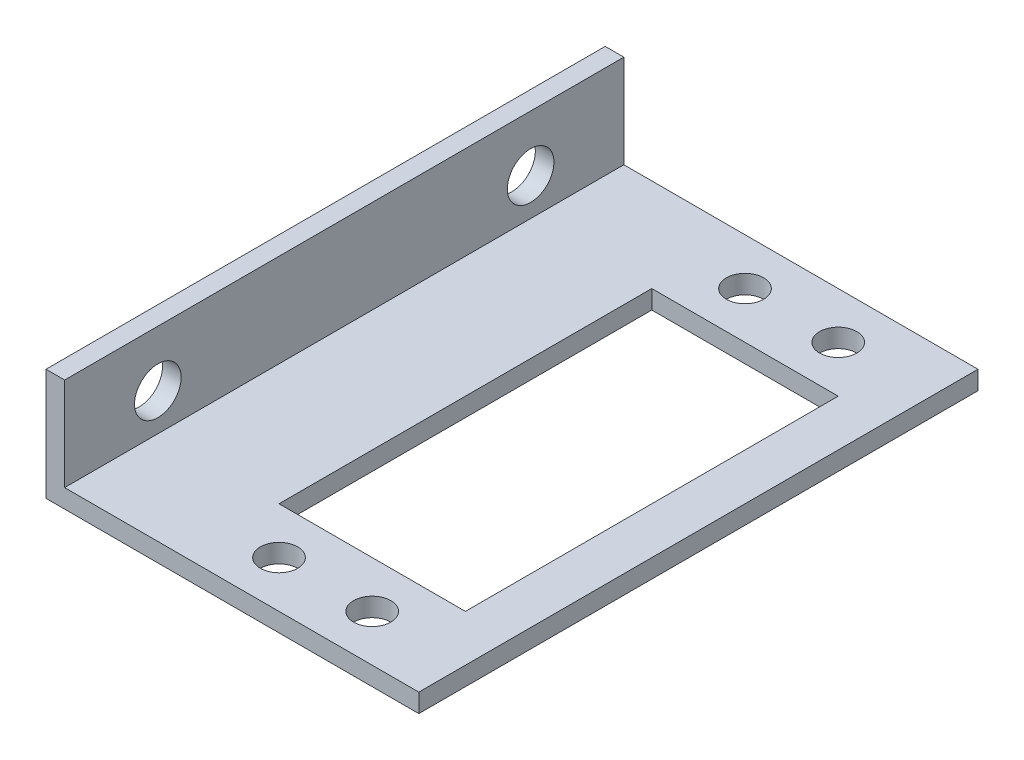
ISO-10303-21;
HEADER;
FILE_DESCRIPTION(('STEP AP214'),'2;1');
FILE_NAME('part.step','',(''),(''),'','','');
FILE_SCHEMA(('AUTOMOTIVE_DESIGN { 1 0 10303 214 1 1 1 1 }'));
ENDSEC;
DATA;
#1=APPLICATION_CONTEXT('core data for automotive mechanical design processes');
#2=APPLICATION_PROTOCOL_DEFINITION('international standard','automotive_design',2000,#1);
#3=PRODUCT_CONTEXT('',#1,'mechanical');
#4=PRODUCT('Part','Part','',(#3));
#5=PRODUCT_RELATED_PRODUCT_CATEGORY('part','',(#4));
#6=PRODUCT_DEFINITION_FORMATION('','',#4);
#7=PRODUCT_DEFINITION_CONTEXT('part definition',#1,'design');
#8=PRODUCT_DEFINITION('design','',#6,#7);
#9=PRODUCT_DEFINITION_SHAPE('','',#8);
#10=(LENGTH_UNIT() NAMED_UNIT(*) SI_UNIT(.MILLI.,.METRE.));
#11=(NAMED_UNIT(*) PLANE_ANGLE_UNIT() SI_UNIT($,.RADIAN.));
#12=(NAMED_UNIT(*) SI_UNIT($,.STERADIAN.) SOLID_ANGLE_UNIT());
#13=UNCERTAINTY_MEASURE_WITH_UNIT(LENGTH_MEASURE(1.E-05),#10,'distance_accuracy_value','');
#14=(GEOMETRIC_REPRESENTATION_CONTEXT(3) GLOBAL_UNCERTAINTY_ASSIGNED_CONTEXT((#13)) GLOBAL_UNIT_ASSIGNED_CONTEXT((#10,
#11,#12)) REPRESENTATION_CONTEXT('',''));
#15=CARTESIAN_POINT('',(0.,0.,0.));
#16=DIRECTION('',(0.,0.,1.));
#17=DIRECTION('',(1.,0.,0.));
#18=AXIS2_PLACEMENT_3D('',#15,#16,#17);
#19=CARTESIAN_POINT('',(-27.3869148760206,0.,60.));
#20=DIRECTION('',(1.,0.,0.));
#21=DIRECTION('',(0.,0.,-1.));
#22=AXIS2_PLACEMENT_3D('',#19,#20,#21);
#23=PLANE('',#22);
#24=CARTESIAN_POINT('',(-27.3869148760206,6.,10.));
#25=DIRECTION('',(-1.,0.,0.));
#26=DIRECTION('',(0.,0.,1.));
#27=AXIS2_PLACEMENT_3D('',#24,#25,#26);
#28=CIRCLE('',#27,2.5);
#29=CARTESIAN_POINT('',(-27.3869148760206,6.,12.5));
#30=VERTEX_POINT('',#29);
#31=EDGE_CURVE('E154',#30,#30,#28,.T.);
#32=ORIENTED_EDGE('',*,*,#31,.F.);
#33=EDGE_LOOP('',(#32));
#34=FACE_BOUND('',#33,.T.);
#35=CARTESIAN_POINT('',(-27.3869148760206,6.,50.));
#36=DIRECTION('',(-1.,0.,0.));
#37=DIRECTION('',(0.,0.,1.));
#38=AXIS2_PLACEMENT_3D('',#35,#36,#37);
#39=CIRCLE('',#38,2.5);
#40=CARTESIAN_POINT('',(-27.3869148760206,6.,52.5));
#41=VERTEX_POINT('',#40);
#42=EDGE_CURVE('E159',#41,#41,#39,.T.);
#43=ORIENTED_EDGE('',*,*,#42,.F.);
#44=EDGE_LOOP('',(#43));
#45=FACE_BOUND('',#44,.T.);
#46=DIRECTION('',(0.,-1.,0.));
#47=VECTOR('',#46,1.);
#48=CARTESIAN_POINT('',(-27.3869148760206,0.,0.));
#49=LINE('',#48,#47);
#50=CARTESIAN_POINT('',(-27.3869148760206,12.,0.));
#51=VERTEX_POINT('',#50);
#52=CARTESIAN_POINT('',(-27.3869148760206,0.,0.));
#53=VERTEX_POINT('',#52);
#54=EDGE_CURVE('E184',#51,#53,#49,.T.);
#55=ORIENTED_EDGE('',*,*,#54,.T.);
#56=DIRECTION('',(0.,0.,-1.));
#57=VECTOR('',#56,1.);
#58=CARTESIAN_POINT('',(-27.3869148760206,0.,60.));
#59=LINE('',#58,#57);
#60=CARTESIAN_POINT('',(-27.3869148760206,0.,60.));
#61=VERTEX_POINT('',#60);
#62=EDGE_CURVE('E222',#61,#53,#59,.T.);
#63=ORIENTED_EDGE('',*,*,#62,.F.);
#64=DIRECTION('',(0.,-1.,0.));
#65=VECTOR('',#64,1.);
#66=CARTESIAN_POINT('',(-27.3869148760206,0.,60.));
#67=LINE('',#66,#65);
#68=CARTESIAN_POINT('',(-27.3869148760206,12.,60.));
#69=VERTEX_POINT('',#68);
#70=EDGE_CURVE('E163',#69,#61,#67,.T.);
#71=ORIENTED_EDGE('',*,*,#70,.F.);
#72=DIRECTION('',(0.,0.,-1.));
#73=VECTOR('',#72,1.);
#74=CARTESIAN_POINT('',(-27.3869148760206,12.,60.));
#75=LINE('',#74,#73);
#76=EDGE_CURVE('E183',#69,#51,#75,.T.);
#77=ORIENTED_EDGE('',*,*,#76,.T.);
#78=EDGE_LOOP('',(#55,#63,#71,#77));
#79=FACE_BOUND('',#78,.T.);
#80=ADVANCED_FACE('F39',(#34,#45,#79),#23,.F.);
#81=CARTESIAN_POINT('',(-27.3869148760206,0.,60.));
#82=DIRECTION('',(0.,1.,0.));
#83=DIRECTION('',(0.,0.,1.));
#84=AXIS2_PLACEMENT_3D('',#81,#82,#83);
#85=PLANE('',#84);
#86=CARTESIAN_POINT('',(2.61308512397936,0.,5.));
#87=DIRECTION('',(0.,-1.,0.));
#88=DIRECTION('',(0.,0.,-1.));
#89=AXIS2_PLACEMENT_3D('',#86,#87,#88);
#90=CIRCLE('',#89,2.);
#91=CARTESIAN_POINT('',(2.61308512397936,0.,3.));
#92=VERTEX_POINT('',#91);
#93=EDGE_CURVE('E352',#92,#92,#90,.T.);
#94=ORIENTED_EDGE('',*,*,#93,.F.);
#95=EDGE_LOOP('',(#94));
#96=FACE_BOUND('',#95,.T.);
#97=CARTESIAN_POINT('',(-7.38691487602064,0.,5.));
#98=DIRECTION('',(0.,-1.,0.));
#99=DIRECTION('',(0.,0.,-1.));
#100=AXIS2_PLACEMENT_3D('',#97,#98,#99);
#101=CIRCLE('',#100,2.);
#102=CARTESIAN_POINT('',(-7.38691487602064,0.,3.));
#103=VERTEX_POINT('',#102);
#104=EDGE_CURVE('E355',#103,#103,#101,.T.);
#105=ORIENTED_EDGE('',*,*,#104,.F.);
#106=EDGE_LOOP('',(#105));
#107=FACE_BOUND('',#106,.T.);
#108=CARTESIAN_POINT('',(2.61308512397936,0.,55.));
#109=DIRECTION('',(0.,-1.,0.));
#110=DIRECTION('',(0.,0.,-1.));
#111=AXIS2_PLACEMENT_3D('',#108,#109,#110);
#112=CIRCLE('',#111,2.);
#113=CARTESIAN_POINT('',(2.61308512397936,0.,53.));
#114=VERTEX_POINT('',#113);
#115=EDGE_CURVE('E349',#114,#114,#112,.T.);
#116=ORIENTED_EDGE('',*,*,#115,.F.);
#117=EDGE_LOOP('',(#116));
#118=FACE_BOUND('',#117,.T.);
#119=CARTESIAN_POINT('',(-7.38691487602064,0.,55.));
#120=DIRECTION('',(0.,-1.,0.));
#121=DIRECTION('',(0.,0.,-1.));
#122=AXIS2_PLACEMENT_3D('',#119,#120,#121);
#123=CIRCLE('',#122,2.);
#124=CARTESIAN_POINT('',(-7.38691487602064,0.,53.));
#125=VERTEX_POINT('',#124);
#126=EDGE_CURVE('E346',#125,#125,#123,.T.);
#127=ORIENTED_EDGE('',*,*,#126,.F.);
#128=EDGE_LOOP('',(#127));
#129=FACE_BOUND('',#128,.T.);
#130=DIRECTION('',(-1.,0.,0.));
#131=VECTOR('',#130,1.);
#132=CARTESIAN_POINT('',(-12.3869148760206,0.,50.));
#133=LINE('',#132,#131);
#134=CARTESIAN_POINT('',(7.61308512397936,0.,50.));
#135=VERTEX_POINT('',#134);
#136=CARTESIAN_POINT('',(-12.3869148760206,0.,50.));
#137=VERTEX_POINT('',#136);
#138=EDGE_CURVE('E131',#135,#137,#133,.T.);
#139=ORIENTED_EDGE('',*,*,#138,.F.);
#140=DIRECTION('',(0.,0.,1.));
#141=VECTOR('',#140,1.);
#142=CARTESIAN_POINT('',(7.61308512397936,0.,50.));
#143=LINE('',#142,#141);
#144=CARTESIAN_POINT('',(7.61308512397937,0.,10.));
#145=VERTEX_POINT('',#144);
#146=EDGE_CURVE('E56',#145,#135,#143,.T.);
#147=ORIENTED_EDGE('',*,*,#146,.F.);
#148=DIRECTION('',(1.,0.,0.));
#149=VECTOR('',#148,1.);
#150=CARTESIAN_POINT('',(-12.3869148760206,0.,10.));
#151=LINE('',#150,#149);
#152=CARTESIAN_POINT('',(-12.3869148760206,0.,10.));
#153=VERTEX_POINT('',#152);
#154=EDGE_CURVE('E139',#153,#145,#151,.T.);
#155=ORIENTED_EDGE('',*,*,#154,.F.);
#156=DIRECTION('',(0.,0.,-1.));
#157=VECTOR('',#156,1.);
#158=CARTESIAN_POINT('',(-12.3869148760206,0.,50.));
#159=LINE('',#158,#157);
#160=EDGE_CURVE('E121',#137,#153,#159,.T.);
#161=ORIENTED_EDGE('',*,*,#160,.F.);
#162=EDGE_LOOP('',(#139,#147,#155,#161));
#163=FACE_BOUND('',#162,.T.);
#164=DIRECTION('',(1.,0.,0.));
#165=VECTOR('',#164,1.);
#166=CARTESIAN_POINT('',(-27.3869148760206,0.,0.));
#167=LINE('',#166,#165);
#168=CARTESIAN_POINT('',(12.6130851239794,0.,0.));
#169=VERTEX_POINT('',#168);
#170=EDGE_CURVE('E188',#53,#169,#167,.T.);
#171=ORIENTED_EDGE('',*,*,#170,.T.);
#172=DIRECTION('',(0.,0.,-1.));
#173=VECTOR('',#172,1.);
#174=CARTESIAN_POINT('',(12.6130851239794,0.,60.));
#175=LINE('',#174,#173);
#176=CARTESIAN_POINT('',(12.6130851239794,0.,60.));
#177=VERTEX_POINT('',#176);
#178=EDGE_CURVE('E218',#177,#169,#175,.T.);
#179=ORIENTED_EDGE('',*,*,#178,.F.);
#180=DIRECTION('',(1.,0.,0.));
#181=VECTOR('',#180,1.);
#182=CARTESIAN_POINT('',(-27.3869148760206,0.,60.));
#183=LINE('',#182,#181);
#184=EDGE_CURVE('E167',#61,#177,#183,.T.);
#185=ORIENTED_EDGE('',*,*,#184,.F.);
#186=ORIENTED_EDGE('',*,*,#62,.T.);
#187=EDGE_LOOP('',(#171,#179,#185,#186));
#188=FACE_BOUND('',#187,.T.);
#189=ADVANCED_FACE('F136',(#96,#107,#118,#129,#163,#188),#85,.F.);
#190=CARTESIAN_POINT('',(12.6130851239794,2.,60.));
#191=DIRECTION('',(-1.,0.,0.));
#192=DIRECTION('',(0.,0.,1.));
#193=AXIS2_PLACEMENT_3D('',#190,#191,#192);
#194=PLANE('',#193);
#195=DIRECTION('',(0.,1.,0.));
#196=VECTOR('',#195,1.);
#197=CARTESIAN_POINT('',(12.6130851239794,2.,0.));
#198=LINE('',#197,#196);
#199=CARTESIAN_POINT('',(12.6130851239794,2.,0.));
#200=VERTEX_POINT('',#199);
#201=EDGE_CURVE('E192',#169,#200,#198,.T.);
#202=ORIENTED_EDGE('',*,*,#201,.T.);
#203=DIRECTION('',(0.,0.,-1.));
#204=VECTOR('',#203,1.);
#205=CARTESIAN_POINT('',(12.6130851239794,2.,60.));
#206=LINE('',#205,#204);
#207=CARTESIAN_POINT('',(12.6130851239794,2.,60.));
#208=VERTEX_POINT('',#207);
#209=EDGE_CURVE('E214',#208,#200,#206,.T.);
#210=ORIENTED_EDGE('',*,*,#209,.F.);
#211=DIRECTION('',(0.,1.,0.));
#212=VECTOR('',#211,1.);
#213=CARTESIAN_POINT('',(12.6130851239794,2.,60.));
#214=LINE('',#213,#212);
#215=EDGE_CURVE('E171',#177,#208,#214,.T.);
#216=ORIENTED_EDGE('',*,*,#215,.F.);
#217=ORIENTED_EDGE('',*,*,#178,.T.);
#218=EDGE_LOOP('',(#202,#210,#216,#217));
#219=FACE_BOUND('',#218,.T.);
#220=ADVANCED_FACE('F275',(#219),#194,.F.);
#221=CARTESIAN_POINT('',(-25.3869148760206,2.,60.));
#222=DIRECTION('',(0.,-1.,0.));
#223=DIRECTION('',(0.,0.,-1.));
#224=AXIS2_PLACEMENT_3D('',#221,#222,#223);
#225=PLANE('',#224);
#226=CARTESIAN_POINT('',(2.61308512397936,2.,5.));
#227=DIRECTION('',(0.,-1.,0.));
#228=DIRECTION('',(0.,0.,-1.));
#229=AXIS2_PLACEMENT_3D('',#226,#227,#228);
#230=CIRCLE('',#229,2.);
#231=CARTESIAN_POINT('',(2.61308512397936,2.,3.));
#232=VERTEX_POINT('',#231);
#233=EDGE_CURVE('E42',#232,#232,#230,.T.);
#234=ORIENTED_EDGE('',*,*,#233,.T.);
#235=EDGE_LOOP('',(#234));
#236=FACE_BOUND('',#235,.T.);
#237=CARTESIAN_POINT('',(-7.38691487602064,2.,5.));
#238=DIRECTION('',(0.,-1.,0.));
#239=DIRECTION('',(0.,0.,-1.));
#240=AXIS2_PLACEMENT_3D('',#237,#238,#239);
#241=CIRCLE('',#240,2.);
#242=CARTESIAN_POINT('',(-7.38691487602064,2.,3.));
#243=VERTEX_POINT('',#242);
#244=EDGE_CURVE('E246',#243,#243,#241,.T.);
#245=ORIENTED_EDGE('',*,*,#244,.T.);
#246=EDGE_LOOP('',(#245));
#247=FACE_BOUND('',#246,.T.);
#248=CARTESIAN_POINT('',(2.61308512397936,2.,55.));
#249=DIRECTION('',(0.,-1.,0.));
#250=DIRECTION('',(0.,0.,-1.));
#251=AXIS2_PLACEMENT_3D('',#248,#249,#250);
#252=CIRCLE('',#251,2.);
#253=CARTESIAN_POINT('',(2.61308512397936,2.,53.));
#254=VERTEX_POINT('',#253);
#255=EDGE_CURVE('E243',#254,#254,#252,.T.);
#256=ORIENTED_EDGE('',*,*,#255,.T.);
#257=EDGE_LOOP('',(#256));
#258=FACE_BOUND('',#257,.T.);
#259=CARTESIAN_POINT('',(-7.38691487602064,2.,55.));
#260=DIRECTION('',(0.,-1.,0.));
#261=DIRECTION('',(0.,0.,-1.));
#262=AXIS2_PLACEMENT_3D('',#259,#260,#261);
#263=CIRCLE('',#262,2.);
#264=CARTESIAN_POINT('',(-7.38691487602064,2.,53.));
#265=VERTEX_POINT('',#264);
#266=EDGE_CURVE('E149',#265,#265,#263,.T.);
#267=ORIENTED_EDGE('',*,*,#266,.T.);
#268=EDGE_LOOP('',(#267));
#269=FACE_BOUND('',#268,.T.);
#270=DIRECTION('',(1.,0.,0.));
#271=VECTOR('',#270,1.);
#272=CARTESIAN_POINT('',(-25.3869148760206,2.,10.));
#273=LINE('',#272,#271);
#274=CARTESIAN_POINT('',(-12.3869148760206,2.,10.));
#275=VERTEX_POINT('',#274);
#276=CARTESIAN_POINT('',(7.61308512397937,2.,10.));
#277=VERTEX_POINT('',#276);
#278=EDGE_CURVE('E48',#275,#277,#273,.T.);
#279=ORIENTED_EDGE('',*,*,#278,.T.);
#280=DIRECTION('',(0.,0.,1.));
#281=VECTOR('',#280,1.);
#282=CARTESIAN_POINT('',(7.61308512397936,2.,60.));
#283=LINE('',#282,#281);
#284=CARTESIAN_POINT('',(7.61308512397936,2.,50.));
#285=VERTEX_POINT('',#284);
#286=EDGE_CURVE('E11',#277,#285,#283,.T.);
#287=ORIENTED_EDGE('',*,*,#286,.T.);
#288=DIRECTION('',(-1.,0.,0.));
#289=VECTOR('',#288,1.);
#290=CARTESIAN_POINT('',(-25.3869148760206,2.,50.));
#291=LINE('',#290,#289);
#292=CARTESIAN_POINT('',(-12.3869148760206,2.,50.));
#293=VERTEX_POINT('',#292);
#294=EDGE_CURVE('E226',#285,#293,#291,.T.);
#295=ORIENTED_EDGE('',*,*,#294,.T.);
#296=DIRECTION('',(0.,0.,-1.));
#297=VECTOR('',#296,1.);
#298=CARTESIAN_POINT('',(-12.3869148760206,2.,60.));
#299=LINE('',#298,#297);
#300=EDGE_CURVE('E124',#293,#275,#299,.T.);
#301=ORIENTED_EDGE('',*,*,#300,.T.);
#302=EDGE_LOOP('',(#279,#287,#295,#301));
#303=FACE_BOUND('',#302,.T.);
#304=DIRECTION('',(-1.,0.,0.));
#305=VECTOR('',#304,1.);
#306=CARTESIAN_POINT('',(-25.3869148760206,2.,0.));
#307=LINE('',#306,#305);
#308=CARTESIAN_POINT('',(-25.3869148760206,2.,0.));
#309=VERTEX_POINT('',#308);
#310=EDGE_CURVE('E195',#200,#309,#307,.T.);
#311=ORIENTED_EDGE('',*,*,#310,.T.);
#312=DIRECTION('',(0.,0.,-1.));
#313=VECTOR('',#312,1.);
#314=CARTESIAN_POINT('',(-25.3869148760206,2.,60.));
#315=LINE('',#314,#313);
#316=CARTESIAN_POINT('',(-25.3869148760206,2.,60.));
#317=VERTEX_POINT('',#316);
#318=EDGE_CURVE('E210',#317,#309,#315,.T.);
#319=ORIENTED_EDGE('',*,*,#318,.F.);
#320=DIRECTION('',(-1.,0.,0.));
#321=VECTOR('',#320,1.);
#322=CARTESIAN_POINT('',(-25.3869148760206,2.,60.));
#323=LINE('',#322,#321);
#324=EDGE_CURVE('E174',#208,#317,#323,.T.);
#325=ORIENTED_EDGE('',*,*,#324,.F.);
#326=ORIENTED_EDGE('',*,*,#209,.T.);
#327=EDGE_LOOP('',(#311,#319,#325,#326));
#328=FACE_BOUND('',#327,.T.);
#329=ADVANCED_FACE('F255',(#236,#247,#258,#269,#303,#328),#225,.F.);
#330=CARTESIAN_POINT('',(-25.3869148760206,12.,60.));
#331=DIRECTION('',(-1.,0.,0.));
#332=DIRECTION('',(0.,0.,1.));
#333=AXIS2_PLACEMENT_3D('',#330,#331,#332);
#334=PLANE('',#333);
#335=CARTESIAN_POINT('',(-25.3869148760206,6.,10.));
#336=DIRECTION('',(-1.,0.,0.));
#337=DIRECTION('',(0.,0.,1.));
#338=AXIS2_PLACEMENT_3D('',#335,#336,#337);
#339=CIRCLE('',#338,2.5);
#340=CARTESIAN_POINT('',(-25.3869148760206,6.,12.5));
#341=VERTEX_POINT('',#340);
#342=EDGE_CURVE('E189',#341,#341,#339,.T.);
#343=ORIENTED_EDGE('',*,*,#342,.T.);
#344=EDGE_LOOP('',(#343));
#345=FACE_BOUND('',#344,.T.);
#346=CARTESIAN_POINT('',(-25.3869148760206,6.,50.));
#347=DIRECTION('',(-1.,0.,0.));
#348=DIRECTION('',(0.,0.,1.));
#349=AXIS2_PLACEMENT_3D('',#346,#347,#348);
#350=CIRCLE('',#349,2.5);
#351=CARTESIAN_POINT('',(-25.3869148760206,6.,52.5));
#352=VERTEX_POINT('',#351);
#353=EDGE_CURVE('E158',#352,#352,#350,.T.);
#354=ORIENTED_EDGE('',*,*,#353,.T.);
#355=EDGE_LOOP('',(#354));
#356=FACE_BOUND('',#355,.T.);
#357=DIRECTION('',(0.,1.,0.));
#358=VECTOR('',#357,1.);
#359=CARTESIAN_POINT('',(-25.3869148760206,12.,0.));
#360=LINE('',#359,#358);
#361=CARTESIAN_POINT('',(-25.3869148760206,12.,0.));
#362=VERTEX_POINT('',#361);
#363=EDGE_CURVE('E198',#309,#362,#360,.T.);
#364=ORIENTED_EDGE('',*,*,#363,.T.);
#365=DIRECTION('',(0.,0.,-1.));
#366=VECTOR('',#365,1.);
#367=CARTESIAN_POINT('',(-25.3869148760206,12.,60.));
#368=LINE('',#367,#366);
#369=CARTESIAN_POINT('',(-25.3869148760206,12.,60.));
#370=VERTEX_POINT('',#369);
#371=EDGE_CURVE('E206',#370,#362,#368,.T.);
#372=ORIENTED_EDGE('',*,*,#371,.F.);
#373=DIRECTION('',(0.,1.,0.));
#374=VECTOR('',#373,1.);
#375=CARTESIAN_POINT('',(-25.3869148760206,12.,60.));
#376=LINE('',#375,#374);
#377=EDGE_CURVE('E177',#317,#370,#376,.T.);
#378=ORIENTED_EDGE('',*,*,#377,.F.);
#379=ORIENTED_EDGE('',*,*,#318,.T.);
#380=EDGE_LOOP('',(#364,#372,#378,#379));
#381=FACE_BOUND('',#380,.T.);
#382=ADVANCED_FACE('F301',(#345,#356,#381),#334,.F.);
#383=CARTESIAN_POINT('',(-27.3869148760206,12.,60.));
#384=DIRECTION('',(0.,-1.,0.));
#385=DIRECTION('',(0.,0.,-1.));
#386=AXIS2_PLACEMENT_3D('',#383,#384,#385);
#387=PLANE('',#386);
#388=DIRECTION('',(-1.,0.,0.));
#389=VECTOR('',#388,1.);
#390=CARTESIAN_POINT('',(-27.3869148760206,12.,0.));
#391=LINE('',#390,#389);
#392=EDGE_CURVE('E168',#362,#51,#391,.T.);
#393=ORIENTED_EDGE('',*,*,#392,.T.);
#394=ORIENTED_EDGE('',*,*,#76,.F.);
#395=DIRECTION('',(-1.,0.,0.));
#396=VECTOR('',#395,1.);
#397=CARTESIAN_POINT('',(-27.3869148760206,12.,60.));
#398=LINE('',#397,#396);
#399=EDGE_CURVE('E180',#370,#69,#398,.T.);
#400=ORIENTED_EDGE('',*,*,#399,.F.);
#401=ORIENTED_EDGE('',*,*,#371,.T.);
#402=EDGE_LOOP('',(#393,#394,#400,#401));
#403=FACE_BOUND('',#402,.T.);
#404=ADVANCED_FACE('F299',(#403),#387,.F.);
#405=CARTESIAN_POINT('',(0.,0.,60.));
#406=DIRECTION('',(0.,0.,-1.));
#407=DIRECTION('',(-1.,0.,0.));
#408=AXIS2_PLACEMENT_3D('',#405,#406,#407);
#409=PLANE('',#408);
#410=ORIENTED_EDGE('',*,*,#70,.T.);
#411=ORIENTED_EDGE('',*,*,#184,.T.);
#412=ORIENTED_EDGE('',*,*,#215,.T.);
#413=ORIENTED_EDGE('',*,*,#324,.T.);
#414=ORIENTED_EDGE('',*,*,#377,.T.);
#415=ORIENTED_EDGE('',*,*,#399,.T.);
#416=EDGE_LOOP('',(#410,#411,#412,#413,#414,#415));
#417=FACE_BOUND('',#416,.T.);
#418=ADVANCED_FACE('F294',(#417),#409,.F.);
#419=CARTESIAN_POINT('',(0.,0.,0.));
#420=DIRECTION('',(0.,0.,-1.));
#421=DIRECTION('',(-1.,0.,0.));
#422=AXIS2_PLACEMENT_3D('',#419,#420,#421);
#423=PLANE('',#422);
#424=ORIENTED_EDGE('',*,*,#54,.F.);
#425=ORIENTED_EDGE('',*,*,#392,.F.);
#426=ORIENTED_EDGE('',*,*,#363,.F.);
#427=ORIENTED_EDGE('',*,*,#310,.F.);
#428=ORIENTED_EDGE('',*,*,#201,.F.);
#429=ORIENTED_EDGE('',*,*,#170,.F.);
#430=EDGE_LOOP('',(#424,#425,#426,#427,#428,#429));
#431=FACE_BOUND('',#430,.T.);
#432=ADVANCED_FACE('F287',(#431),#423,.T.);
#433=CARTESIAN_POINT('',(32.6130851239794,6.,50.));
#434=DIRECTION('',(-1.,0.,0.));
#435=DIRECTION('',(0.,0.,1.));
#436=AXIS2_PLACEMENT_3D('',#433,#434,#435);
#437=CYLINDRICAL_SURFACE('',#436,2.5);
#438=ORIENTED_EDGE('',*,*,#42,.T.);
#439=EDGE_LOOP('',(#438));
#440=FACE_BOUND('',#439,.T.);
#441=ORIENTED_EDGE('',*,*,#353,.F.);
#442=EDGE_LOOP('',(#441));
#443=FACE_BOUND('',#442,.T.);
#444=ADVANCED_FACE('F321',(#440,#443),#437,.F.);
#445=CARTESIAN_POINT('',(32.6130851239794,6.,10.));
#446=DIRECTION('',(-1.,0.,0.));
#447=DIRECTION('',(0.,0.,1.));
#448=AXIS2_PLACEMENT_3D('',#445,#446,#447);
#449=CYLINDRICAL_SURFACE('',#448,2.5);
#450=ORIENTED_EDGE('',*,*,#31,.T.);
#451=EDGE_LOOP('',(#450));
#452=FACE_BOUND('',#451,.T.);
#453=ORIENTED_EDGE('',*,*,#342,.F.);
#454=EDGE_LOOP('',(#453));
#455=FACE_BOUND('',#454,.T.);
#456=ADVANCED_FACE('F326',(#452,#455),#449,.F.);
#457=CARTESIAN_POINT('',(7.61308512397936,60.,50.));
#458=DIRECTION('',(1.,0.,0.));
#459=DIRECTION('',(0.,0.,-1.));
#460=AXIS2_PLACEMENT_3D('',#457,#458,#459);
#461=PLANE('',#460);
#462=DIRECTION('',(0.,-1.,0.));
#463=VECTOR('',#462,1.);
#464=CARTESIAN_POINT('',(7.61308512397937,60.,10.));
#465=LINE('',#464,#463);
#466=EDGE_CURVE('E146',#277,#145,#465,.T.);
#467=ORIENTED_EDGE('',*,*,#466,.T.);
#468=ORIENTED_EDGE('',*,*,#146,.T.);
#469=DIRECTION('',(0.,-1.,0.));
#470=VECTOR('',#469,1.);
#471=CARTESIAN_POINT('',(7.61308512397936,60.,50.));
#472=LINE('',#471,#470);
#473=EDGE_CURVE('E128',#285,#135,#472,.T.);
#474=ORIENTED_EDGE('',*,*,#473,.F.);
#475=ORIENTED_EDGE('',*,*,#286,.F.);
#476=EDGE_LOOP('',(#467,#468,#474,#475));
#477=FACE_BOUND('',#476,.T.);
#478=ADVANCED_FACE('F330',(#477),#461,.F.);
#479=CARTESIAN_POINT('',(-12.3869148760206,60.,10.));
#480=DIRECTION('',(0.,0.,-1.));
#481=DIRECTION('',(-1.,0.,0.));
#482=AXIS2_PLACEMENT_3D('',#479,#480,#481);
#483=PLANE('',#482);
#484=DIRECTION('',(0.,-1.,0.));
#485=VECTOR('',#484,1.);
#486=CARTESIAN_POINT('',(-12.3869148760206,60.,10.));
#487=LINE('',#486,#485);
#488=EDGE_CURVE('E127',#275,#153,#487,.T.);
#489=ORIENTED_EDGE('',*,*,#488,.T.);
#490=ORIENTED_EDGE('',*,*,#154,.T.);
#491=ORIENTED_EDGE('',*,*,#466,.F.);
#492=ORIENTED_EDGE('',*,*,#278,.F.);
#493=EDGE_LOOP('',(#489,#490,#491,#492));
#494=FACE_BOUND('',#493,.T.);
#495=ADVANCED_FACE('F334',(#494),#483,.F.);
#496=CARTESIAN_POINT('',(-12.3869148760206,60.,50.));
#497=DIRECTION('',(-1.,0.,0.));
#498=DIRECTION('',(0.,0.,1.));
#499=AXIS2_PLACEMENT_3D('',#496,#497,#498);
#500=PLANE('',#499);
#501=DIRECTION('',(0.,-1.,0.));
#502=VECTOR('',#501,1.);
#503=CARTESIAN_POINT('',(-12.3869148760206,60.,50.));
#504=LINE('',#503,#502);
#505=EDGE_CURVE('E64',#293,#137,#504,.T.);
#506=ORIENTED_EDGE('',*,*,#505,.T.);
#507=ORIENTED_EDGE('',*,*,#160,.T.);
#508=ORIENTED_EDGE('',*,*,#488,.F.);
#509=ORIENTED_EDGE('',*,*,#300,.F.);
#510=EDGE_LOOP('',(#506,#507,#508,#509));
#511=FACE_BOUND('',#510,.T.);
#512=ADVANCED_FACE('F118',(#511),#500,.F.);
#513=CARTESIAN_POINT('',(-12.3869148760206,60.,50.));
#514=DIRECTION('',(0.,0.,1.));
#515=DIRECTION('',(1.,0.,0.));
#516=AXIS2_PLACEMENT_3D('',#513,#514,#515);
#517=PLANE('',#516);
#518=ORIENTED_EDGE('',*,*,#473,.T.);
#519=ORIENTED_EDGE('',*,*,#138,.T.);
#520=ORIENTED_EDGE('',*,*,#505,.F.);
#521=ORIENTED_EDGE('',*,*,#294,.F.);
#522=EDGE_LOOP('',(#518,#519,#520,#521));
#523=FACE_BOUND('',#522,.T.);
#524=ADVANCED_FACE('F132',(#523),#517,.F.);
#525=CARTESIAN_POINT('',(-7.38691487602064,60.,55.));
#526=DIRECTION('',(0.,-1.,0.));
#527=DIRECTION('',(0.,0.,-1.));
#528=AXIS2_PLACEMENT_3D('',#525,#526,#527);
#529=CYLINDRICAL_SURFACE('',#528,2.);
#530=ORIENTED_EDGE('',*,*,#126,.T.);
#531=EDGE_LOOP('',(#530));
#532=FACE_BOUND('',#531,.T.);
#533=ORIENTED_EDGE('',*,*,#266,.F.);
#534=EDGE_LOOP('',(#533));
#535=FACE_BOUND('',#534,.T.);
#536=ADVANCED_FACE('F337',(#532,#535),#529,.F.);
#537=CARTESIAN_POINT('',(2.61308512397936,60.,55.));
#538=DIRECTION('',(0.,-1.,0.));
#539=DIRECTION('',(0.,0.,-1.));
#540=AXIS2_PLACEMENT_3D('',#537,#538,#539);
#541=CYLINDRICAL_SURFACE('',#540,2.);
#542=ORIENTED_EDGE('',*,*,#115,.T.);
#543=EDGE_LOOP('',(#542));
#544=FACE_BOUND('',#543,.T.);
#545=ORIENTED_EDGE('',*,*,#255,.F.);
#546=EDGE_LOOP('',(#545));
#547=FACE_BOUND('',#546,.T.);
#548=ADVANCED_FACE('F265',(#544,#547),#541,.F.);
#549=CARTESIAN_POINT('',(-7.38691487602064,60.,5.));
#550=DIRECTION('',(0.,-1.,0.));
#551=DIRECTION('',(0.,0.,-1.));
#552=AXIS2_PLACEMENT_3D('',#549,#550,#551);
#553=CYLINDRICAL_SURFACE('',#552,2.);
#554=ORIENTED_EDGE('',*,*,#104,.T.);
#555=EDGE_LOOP('',(#554));
#556=FACE_BOUND('',#555,.T.);
#557=ORIENTED_EDGE('',*,*,#244,.F.);
#558=EDGE_LOOP('',(#557));
#559=FACE_BOUND('',#558,.T.);
#560=ADVANCED_FACE('F259',(#556,#559),#553,.F.);
#561=CARTESIAN_POINT('',(2.61308512397936,60.,5.));
#562=DIRECTION('',(0.,-1.,0.));
#563=DIRECTION('',(0.,0.,-1.));
#564=AXIS2_PLACEMENT_3D('',#561,#562,#563);
#565=CYLINDRICAL_SURFACE('',#564,2.);
#566=ORIENTED_EDGE('',*,*,#93,.T.);
#567=EDGE_LOOP('',(#566));
#568=FACE_BOUND('',#567,.T.);
#569=ORIENTED_EDGE('',*,*,#233,.F.);
#570=EDGE_LOOP('',(#569));
#571=FACE_BOUND('',#570,.T.);
#572=ADVANCED_FACE('F257',(#568,#571),#565,.F.);
#573=CLOSED_SHELL('',(#80,#189,#220,#329,#382,#404,#418,#432,#444,#456,#478,#495,#512,#524,#536,
#548,#560,#572));
#574=MANIFOLD_SOLID_BREP('B2',#573);
#575=ADVANCED_BREP_SHAPE_REPRESENTATION('',(#18,#574),#14);
#576=SHAPE_DEFINITION_REPRESENTATION(#9,#575);
ENDSEC;
END-ISO-10303-21;
